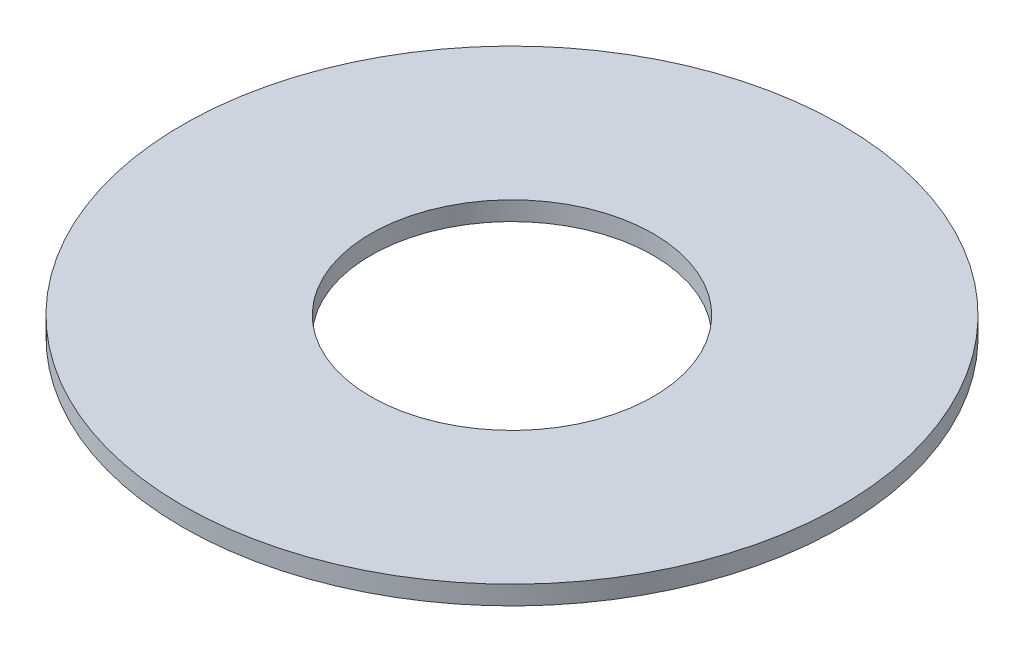
ISO-10303-21;
HEADER;
FILE_DESCRIPTION(('STEP AP214'),'2;1');
FILE_NAME('part.step','',(''),(''),'','','');
FILE_SCHEMA(('AUTOMOTIVE_DESIGN { 1 0 10303 214 1 1 1 1 }'));
ENDSEC;
DATA;
#1=APPLICATION_CONTEXT('core data for automotive mechanical design processes');
#2=APPLICATION_PROTOCOL_DEFINITION('international standard','automotive_design',2000,#1);
#3=PRODUCT_CONTEXT('',#1,'mechanical');
#4=PRODUCT('Part','Part','',(#3));
#5=PRODUCT_RELATED_PRODUCT_CATEGORY('part','',(#4));
#6=PRODUCT_DEFINITION_FORMATION('','',#4);
#7=PRODUCT_DEFINITION_CONTEXT('part definition',#1,'design');
#8=PRODUCT_DEFINITION('design','',#6,#7);
#9=PRODUCT_DEFINITION_SHAPE('','',#8);
#10=(LENGTH_UNIT() NAMED_UNIT(*) SI_UNIT(.MILLI.,.METRE.));
#11=(NAMED_UNIT(*) PLANE_ANGLE_UNIT() SI_UNIT($,.RADIAN.));
#12=(NAMED_UNIT(*) SI_UNIT($,.STERADIAN.) SOLID_ANGLE_UNIT());
#13=UNCERTAINTY_MEASURE_WITH_UNIT(LENGTH_MEASURE(1.E-05),#10,'distance_accuracy_value','');
#14=(GEOMETRIC_REPRESENTATION_CONTEXT(3) GLOBAL_UNCERTAINTY_ASSIGNED_CONTEXT((#13)) GLOBAL_UNIT_ASSIGNED_CONTEXT((#10,
#11,#12)) REPRESENTATION_CONTEXT('',''));
#15=CARTESIAN_POINT('',(0.,0.,0.));
#16=DIRECTION('',(0.,0.,1.));
#17=DIRECTION('',(1.,0.,0.));
#18=AXIS2_PLACEMENT_3D('',#15,#16,#17);
#19=CARTESIAN_POINT('',(0.,5.,0.));
#20=DIRECTION('',(0.,-1.,0.));
#21=DIRECTION('',(0.,0.,-1.));
#22=AXIS2_PLACEMENT_3D('',#19,#20,#21);
#23=CYLINDRICAL_SURFACE('',#22,87.5);
#24=CARTESIAN_POINT('',(0.,5.,0.));
#25=DIRECTION('',(0.,1.,0.));
#26=DIRECTION('',(0.,0.,1.));
#27=AXIS2_PLACEMENT_3D('',#24,#25,#26);
#28=CIRCLE('',#27,87.5);
#29=CARTESIAN_POINT('',(0.,5.,87.5));
#30=VERTEX_POINT('',#29);
#31=EDGE_CURVE('E10',#30,#30,#28,.T.);
#32=ORIENTED_EDGE('',*,*,#31,.F.);
#33=EDGE_LOOP('',(#32));
#34=FACE_BOUND('',#33,.T.);
#35=CARTESIAN_POINT('',(0.,0.,0.));
#36=DIRECTION('',(0.,1.,0.));
#37=DIRECTION('',(0.,0.,1.));
#38=AXIS2_PLACEMENT_3D('',#35,#36,#37);
#39=CIRCLE('',#38,87.5);
#40=CARTESIAN_POINT('',(0.,0.,87.5));
#41=VERTEX_POINT('',#40);
#42=EDGE_CURVE('E37',#41,#41,#39,.T.);
#43=ORIENTED_EDGE('',*,*,#42,.T.);
#44=EDGE_LOOP('',(#43));
#45=FACE_BOUND('',#44,.T.);
#46=ADVANCED_FACE('F40',(#34,#45),#23,.T.);
#47=CARTESIAN_POINT('',(0.,5.,0.));
#48=DIRECTION('',(0.,1.,0.));
#49=DIRECTION('',(0.,0.,1.));
#50=AXIS2_PLACEMENT_3D('',#47,#48,#49);
#51=PLANE('',#50);
#52=CARTESIAN_POINT('',(0.,5.,0.));
#53=DIRECTION('',(0.,1.,0.));
#54=DIRECTION('',(0.,0.,1.));
#55=AXIS2_PLACEMENT_3D('',#52,#53,#54);
#56=CIRCLE('',#55,37.5);
#57=CARTESIAN_POINT('',(0.,5.,37.5));
#58=VERTEX_POINT('',#57);
#59=EDGE_CURVE('E50',#58,#58,#56,.T.);
#60=ORIENTED_EDGE('',*,*,#59,.F.);
#61=EDGE_LOOP('',(#60));
#62=FACE_BOUND('',#61,.T.);
#63=ORIENTED_EDGE('',*,*,#31,.T.);
#64=EDGE_LOOP('',(#63));
#65=FACE_BOUND('',#64,.T.);
#66=ADVANCED_FACE('F59',(#62,#65),#51,.T.);
#67=CARTESIAN_POINT('',(0.,0.,0.));
#68=DIRECTION('',(0.,1.,0.));
#69=DIRECTION('',(0.,0.,1.));
#70=AXIS2_PLACEMENT_3D('',#67,#68,#69);
#71=PLANE('',#70);
#72=CARTESIAN_POINT('',(0.,0.,0.));
#73=DIRECTION('',(0.,1.,0.));
#74=DIRECTION('',(0.,0.,1.));
#75=AXIS2_PLACEMENT_3D('',#72,#73,#74);
#76=CIRCLE('',#75,37.5);
#77=CARTESIAN_POINT('',(0.,0.,37.5));
#78=VERTEX_POINT('',#77);
#79=EDGE_CURVE('E47',#78,#78,#76,.T.);
#80=ORIENTED_EDGE('',*,*,#79,.T.);
#81=EDGE_LOOP('',(#80));
#82=FACE_BOUND('',#81,.T.);
#83=ORIENTED_EDGE('',*,*,#42,.F.);
#84=EDGE_LOOP('',(#83));
#85=FACE_BOUND('',#84,.T.);
#86=ADVANCED_FACE('F58',(#82,#85),#71,.F.);
#87=CARTESIAN_POINT('',(0.,5.,0.));
#88=DIRECTION('',(0.,-1.,0.));
#89=DIRECTION('',(0.,0.,-1.));
#90=AXIS2_PLACEMENT_3D('',#87,#88,#89);
#91=CYLINDRICAL_SURFACE('',#90,37.5);
#92=ORIENTED_EDGE('',*,*,#59,.T.);
#93=EDGE_LOOP('',(#92));
#94=FACE_BOUND('',#93,.T.);
#95=ORIENTED_EDGE('',*,*,#79,.F.);
#96=EDGE_LOOP('',(#95));
#97=FACE_BOUND('',#96,.T.);
#98=ADVANCED_FACE('F54',(#94,#97),#91,.F.);
#99=CLOSED_SHELL('',(#46,#66,#86,#98));
#100=MANIFOLD_SOLID_BREP('B2',#99);
#101=ADVANCED_BREP_SHAPE_REPRESENTATION('',(#18,#100),#14);
#102=SHAPE_DEFINITION_REPRESENTATION(#9,#101);
ENDSEC;
END-ISO-10303-21;
